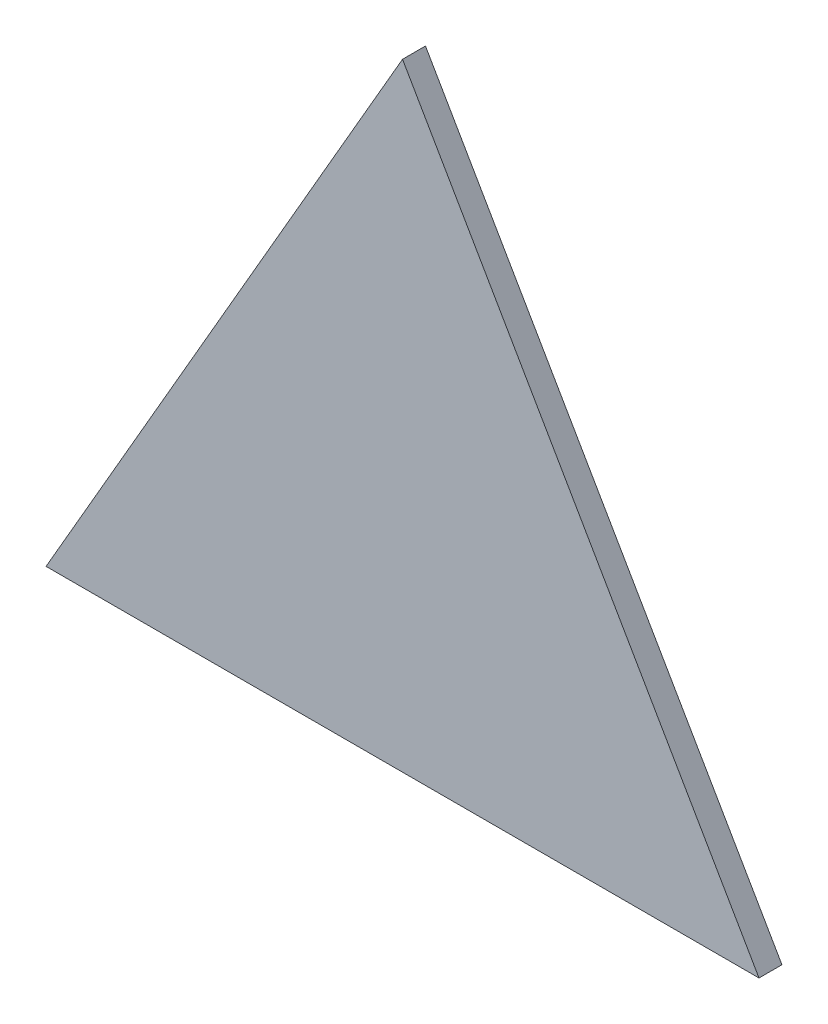
ISO-10303-21;
HEADER;
FILE_DESCRIPTION(('STEP AP214'),'2;1');
FILE_NAME('part.step','',(''),(''),'','','');
FILE_SCHEMA(('AUTOMOTIVE_DESIGN { 1 0 10303 214 1 1 1 1 }'));
ENDSEC;
DATA;
#1=APPLICATION_CONTEXT('core data for automotive mechanical design processes');
#2=APPLICATION_PROTOCOL_DEFINITION('international standard','automotive_design',2000,#1);
#3=PRODUCT_CONTEXT('',#1,'mechanical');
#4=PRODUCT('Part','Part','',(#3));
#5=PRODUCT_RELATED_PRODUCT_CATEGORY('part','',(#4));
#6=PRODUCT_DEFINITION_FORMATION('','',#4);
#7=PRODUCT_DEFINITION_CONTEXT('part definition',#1,'design');
#8=PRODUCT_DEFINITION('design','',#6,#7);
#9=PRODUCT_DEFINITION_SHAPE('','',#8);
#10=(LENGTH_UNIT() NAMED_UNIT(*) SI_UNIT(.MILLI.,.METRE.));
#11=(NAMED_UNIT(*) PLANE_ANGLE_UNIT() SI_UNIT($,.RADIAN.));
#12=(NAMED_UNIT(*) SI_UNIT($,.STERADIAN.) SOLID_ANGLE_UNIT());
#13=UNCERTAINTY_MEASURE_WITH_UNIT(LENGTH_MEASURE(1.E-05),#10,'distance_accuracy_value','');
#14=(GEOMETRIC_REPRESENTATION_CONTEXT(3) GLOBAL_UNCERTAINTY_ASSIGNED_CONTEXT((#13)) GLOBAL_UNIT_ASSIGNED_CONTEXT((#10,
#11,#12)) REPRESENTATION_CONTEXT('',''));
#15=CARTESIAN_POINT('',(0.,0.,0.));
#16=DIRECTION('',(0.,0.,1.));
#17=DIRECTION('',(1.,0.,0.));
#18=AXIS2_PLACEMENT_3D('',#15,#16,#17);
#19=CARTESIAN_POINT('',(-90.2921836495029,340.365254290492,337.137763460333));
#20=DIRECTION('',(0.,-1.,0.));
#21=DIRECTION('',(1.,0.,0.));
#22=AXIS2_PLACEMENT_3D('',#19,#20,#21);
#23=PLANE('',#22);
#24=DIRECTION('',(-1.,0.,0.));
#25=VECTOR('',#24,1.);
#26=CARTESIAN_POINT('',(-90.2921836495029,340.365254290492,325.231513460333));
#27=LINE('',#26,#25);
#28=CARTESIAN_POINT('',(279.709293722444,340.365254290491,325.231513460333));
#29=VERTEX_POINT('',#28);
#30=CARTESIAN_POINT('',(-90.2921836495029,340.365254290492,325.231513460333));
#31=VERTEX_POINT('',#30);
#32=EDGE_CURVE('E85',#29,#31,#27,.T.);
#33=ORIENTED_EDGE('',*,*,#32,.F.);
#34=DIRECTION('',(0.,0.,-1.));
#35=VECTOR('',#34,1.);
#36=CARTESIAN_POINT('',(279.709293722444,340.365254290491,337.137763460333));
#37=LINE('',#36,#35);
#38=CARTESIAN_POINT('',(279.709293722444,340.365254290491,337.137763460333));
#39=VERTEX_POINT('',#38);
#40=EDGE_CURVE('E11',#39,#29,#37,.T.);
#41=ORIENTED_EDGE('',*,*,#40,.F.);
#42=DIRECTION('',(-1.,0.,0.));
#43=VECTOR('',#42,1.);
#44=CARTESIAN_POINT('',(-90.2921836495029,340.365254290492,337.137763460333));
#45=LINE('',#44,#43);
#46=CARTESIAN_POINT('',(-90.2921836495029,340.365254290492,337.137763460333));
#47=VERTEX_POINT('',#46);
#48=EDGE_CURVE('E77',#39,#47,#45,.T.);
#49=ORIENTED_EDGE('',*,*,#48,.T.);
#50=DIRECTION('',(0.,0.,-1.));
#51=VECTOR('',#50,1.);
#52=CARTESIAN_POINT('',(-90.2921836495029,340.365254290492,337.137763460333));
#53=LINE('',#52,#51);
#54=EDGE_CURVE('E36',#47,#31,#53,.T.);
#55=ORIENTED_EDGE('',*,*,#54,.T.);
#56=EDGE_LOOP('',(#33,#41,#49,#55));
#57=FACE_BOUND('',#56,.T.);
#58=ADVANCED_FACE('F33',(#57),#23,.T.);
#59=CARTESIAN_POINT('',(279.709293722444,340.365254290491,337.137763460333));
#60=DIRECTION('',(0.866025403784433,0.500000000000009,0.));
#61=DIRECTION('',(-0.500000000000009,0.866025403784433,0.));
#62=AXIS2_PLACEMENT_3D('',#59,#60,#61);
#63=PLANE('',#62);
#64=DIRECTION('',(0.500000000000009,-0.866025403784433,0.));
#65=VECTOR('',#64,1.);
#66=CARTESIAN_POINT('',(279.709293722444,340.365254290491,325.231513460333));
#67=LINE('',#66,#65);
#68=CARTESIAN_POINT('',(94.7085550364682,660.795933132367,325.231513460333));
#69=VERTEX_POINT('',#68);
#70=EDGE_CURVE('E79',#69,#29,#67,.T.);
#71=ORIENTED_EDGE('',*,*,#70,.F.);
#72=DIRECTION('',(0.,0.,-1.));
#73=VECTOR('',#72,1.);
#74=CARTESIAN_POINT('',(94.7085550364682,660.795933132367,337.137763460333));
#75=LINE('',#74,#73);
#76=CARTESIAN_POINT('',(94.7085550364682,660.795933132367,337.137763460333));
#77=VERTEX_POINT('',#76);
#78=EDGE_CURVE('E42',#77,#69,#75,.T.);
#79=ORIENTED_EDGE('',*,*,#78,.F.);
#80=DIRECTION('',(0.500000000000009,-0.866025403784433,0.));
#81=VECTOR('',#80,1.);
#82=CARTESIAN_POINT('',(279.709293722444,340.365254290491,337.137763460333));
#83=LINE('',#82,#81);
#84=EDGE_CURVE('E74',#77,#39,#83,.T.);
#85=ORIENTED_EDGE('',*,*,#84,.T.);
#86=ORIENTED_EDGE('',*,*,#40,.T.);
#87=EDGE_LOOP('',(#71,#79,#85,#86));
#88=FACE_BOUND('',#87,.T.);
#89=ADVANCED_FACE('F89',(#88),#63,.T.);
#90=CARTESIAN_POINT('',(94.7085550364682,660.795933132367,337.137763460333));
#91=DIRECTION('',(-0.866025403784438,0.500000000000001,0.));
#92=DIRECTION('',(-0.500000000000001,-0.866025403784438,0.));
#93=AXIS2_PLACEMENT_3D('',#90,#91,#92);
#94=PLANE('',#93);
#95=DIRECTION('',(0.500000000000001,0.866025403784438,0.));
#96=VECTOR('',#95,1.);
#97=CARTESIAN_POINT('',(94.7085550364682,660.795933132367,325.231513460333));
#98=LINE('',#97,#96);
#99=EDGE_CURVE('E72',#31,#69,#98,.T.);
#100=ORIENTED_EDGE('',*,*,#99,.F.);
#101=ORIENTED_EDGE('',*,*,#54,.F.);
#102=DIRECTION('',(0.500000000000001,0.866025403784438,0.));
#103=VECTOR('',#102,1.);
#104=CARTESIAN_POINT('',(94.7085550364682,660.795933132367,337.137763460333));
#105=LINE('',#104,#103);
#106=EDGE_CURVE('E70',#47,#77,#105,.T.);
#107=ORIENTED_EDGE('',*,*,#106,.T.);
#108=ORIENTED_EDGE('',*,*,#78,.T.);
#109=EDGE_LOOP('',(#100,#101,#107,#108));
#110=FACE_BOUND('',#109,.T.);
#111=ADVANCED_FACE('F69',(#110),#94,.T.);
#112=CARTESIAN_POINT('',(0.,0.,337.137763460333));
#113=DIRECTION('',(0.,0.,1.));
#114=DIRECTION('',(1.,0.,0.));
#115=AXIS2_PLACEMENT_3D('',#112,#113,#114);
#116=PLANE('',#115);
#117=ORIENTED_EDGE('',*,*,#48,.F.);
#118=ORIENTED_EDGE('',*,*,#84,.F.);
#119=ORIENTED_EDGE('',*,*,#106,.F.);
#120=EDGE_LOOP('',(#117,#118,#119));
#121=FACE_BOUND('',#120,.T.);
#122=ADVANCED_FACE('F76',(#121),#116,.T.);
#123=CARTESIAN_POINT('',(0.,0.,325.231513460333));
#124=DIRECTION('',(0.,0.,1.));
#125=DIRECTION('',(1.,0.,0.));
#126=AXIS2_PLACEMENT_3D('',#123,#124,#125);
#127=PLANE('',#126);
#128=ORIENTED_EDGE('',*,*,#32,.T.);
#129=ORIENTED_EDGE('',*,*,#99,.T.);
#130=ORIENTED_EDGE('',*,*,#70,.T.);
#131=EDGE_LOOP('',(#128,#129,#130));
#132=FACE_BOUND('',#131,.T.);
#133=ADVANCED_FACE('F88',(#132),#127,.F.);
#134=CLOSED_SHELL('',(#58,#89,#111,#122,#133));
#135=MANIFOLD_SOLID_BREP('B2',#134);
#136=ADVANCED_BREP_SHAPE_REPRESENTATION('',(#18,#135),#14);
#137=SHAPE_DEFINITION_REPRESENTATION(#9,#136);
ENDSEC;
END-ISO-10303-21;
